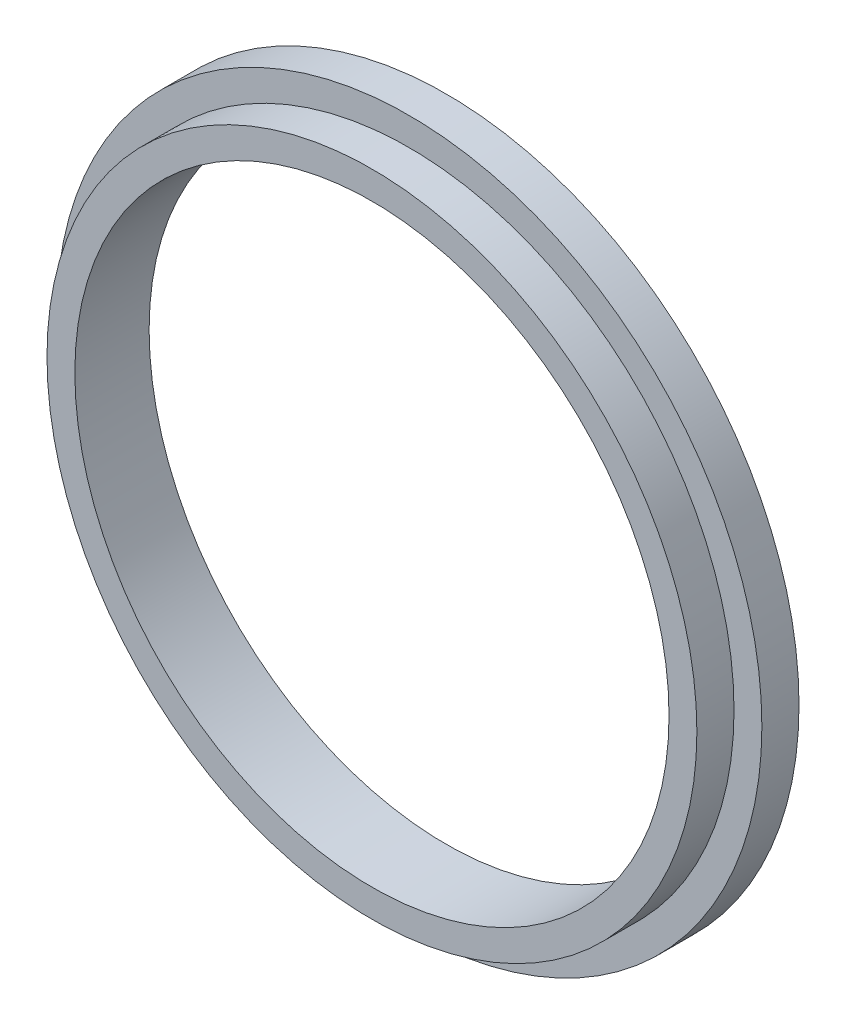
ISO-10303-21;
HEADER;
FILE_DESCRIPTION(('STEP AP214'),'2;1');
FILE_NAME('part.step','',(''),(''),'','','');
FILE_SCHEMA(('AUTOMOTIVE_DESIGN { 1 0 10303 214 1 1 1 1 }'));
ENDSEC;
DATA;
#1=APPLICATION_CONTEXT('core data for automotive mechanical design processes');
#2=APPLICATION_PROTOCOL_DEFINITION('international standard','automotive_design',2000,#1);
#3=PRODUCT_CONTEXT('',#1,'mechanical');
#4=PRODUCT('Part','Part','',(#3));
#5=PRODUCT_RELATED_PRODUCT_CATEGORY('part','',(#4));
#6=PRODUCT_DEFINITION_FORMATION('','',#4);
#7=PRODUCT_DEFINITION_CONTEXT('part definition',#1,'design');
#8=PRODUCT_DEFINITION('design','',#6,#7);
#9=PRODUCT_DEFINITION_SHAPE('','',#8);
#10=(LENGTH_UNIT() NAMED_UNIT(*) SI_UNIT(.MILLI.,.METRE.));
#11=(NAMED_UNIT(*) PLANE_ANGLE_UNIT() SI_UNIT($,.RADIAN.));
#12=(NAMED_UNIT(*) SI_UNIT($,.STERADIAN.) SOLID_ANGLE_UNIT());
#13=UNCERTAINTY_MEASURE_WITH_UNIT(LENGTH_MEASURE(1.E-05),#10,'distance_accuracy_value','');
#14=(GEOMETRIC_REPRESENTATION_CONTEXT(3) GLOBAL_UNCERTAINTY_ASSIGNED_CONTEXT((#13)) GLOBAL_UNIT_ASSIGNED_CONTEXT((#10,
#11,#12)) REPRESENTATION_CONTEXT('',''));
#15=CARTESIAN_POINT('',(0.,0.,0.));
#16=DIRECTION('',(0.,0.,1.));
#17=DIRECTION('',(1.,0.,0.));
#18=AXIS2_PLACEMENT_3D('',#15,#16,#17);
#19=CARTESIAN_POINT('',(0.,0.,20.));
#20=DIRECTION('',(0.,0.,1.));
#21=DIRECTION('',(1.,0.,0.));
#22=AXIS2_PLACEMENT_3D('',#19,#20,#21);
#23=PLANE('',#22);
#24=CARTESIAN_POINT('',(0.,0.,20.));
#25=DIRECTION('',(0.,0.,1.));
#26=DIRECTION('',(1.,0.,0.));
#27=AXIS2_PLACEMENT_3D('',#24,#25,#26);
#28=CIRCLE('',#27,190.);
#29=CARTESIAN_POINT('',(190.,0.,20.));
#30=VERTEX_POINT('',#29);
#31=EDGE_CURVE('E10',#30,#30,#28,.T.);
#32=ORIENTED_EDGE('',*,*,#31,.T.);
#33=EDGE_LOOP('',(#32));
#34=FACE_BOUND('',#33,.T.);
#35=CARTESIAN_POINT('',(0.,0.,20.));
#36=DIRECTION('',(0.,0.,1.));
#37=DIRECTION('',(1.,0.,0.));
#38=AXIS2_PLACEMENT_3D('',#35,#36,#37);
#39=CIRCLE('',#38,175.);
#40=CARTESIAN_POINT('',(175.,0.,20.));
#41=VERTEX_POINT('',#40);
#42=EDGE_CURVE('E52',#41,#41,#39,.T.);
#43=ORIENTED_EDGE('',*,*,#42,.F.);
#44=EDGE_LOOP('',(#43));
#45=FACE_BOUND('',#44,.T.);
#46=ADVANCED_FACE('F36',(#34,#45),#23,.T.);
#47=CARTESIAN_POINT('',(0.,0.,0.));
#48=DIRECTION('',(0.,0.,1.));
#49=DIRECTION('',(1.,0.,0.));
#50=AXIS2_PLACEMENT_3D('',#47,#48,#49);
#51=PLANE('',#50);
#52=CARTESIAN_POINT('',(0.,0.,0.));
#53=DIRECTION('',(0.,0.,1.));
#54=DIRECTION('',(1.,0.,0.));
#55=AXIS2_PLACEMENT_3D('',#52,#53,#54);
#56=CIRCLE('',#55,190.);
#57=CARTESIAN_POINT('',(190.,0.,0.));
#58=VERTEX_POINT('',#57);
#59=EDGE_CURVE('E40',#58,#58,#56,.T.);
#60=ORIENTED_EDGE('',*,*,#59,.F.);
#61=EDGE_LOOP('',(#60));
#62=FACE_BOUND('',#61,.T.);
#63=CARTESIAN_POINT('',(0.,0.,0.));
#64=DIRECTION('',(0.,0.,1.));
#65=DIRECTION('',(1.,0.,0.));
#66=AXIS2_PLACEMENT_3D('',#63,#64,#65);
#67=CIRCLE('',#66,160.);
#68=CARTESIAN_POINT('',(160.,0.,0.));
#69=VERTEX_POINT('',#68);
#70=EDGE_CURVE('E47',#69,#69,#67,.T.);
#71=ORIENTED_EDGE('',*,*,#70,.T.);
#72=EDGE_LOOP('',(#71));
#73=FACE_BOUND('',#72,.T.);
#74=ADVANCED_FACE('F77',(#62,#73),#51,.F.);
#75=CARTESIAN_POINT('',(0.,0.,20.));
#76=DIRECTION('',(0.,0.,-1.));
#77=DIRECTION('',(-1.,0.,0.));
#78=AXIS2_PLACEMENT_3D('',#75,#76,#77);
#79=CYLINDRICAL_SURFACE('',#78,190.);
#80=ORIENTED_EDGE('',*,*,#31,.F.);
#81=EDGE_LOOP('',(#80));
#82=FACE_BOUND('',#81,.T.);
#83=ORIENTED_EDGE('',*,*,#59,.T.);
#84=EDGE_LOOP('',(#83));
#85=FACE_BOUND('',#84,.T.);
#86=ADVANCED_FACE('F38',(#82,#85),#79,.T.);
#87=CARTESIAN_POINT('',(0.,0.,20.));
#88=DIRECTION('',(0.,0.,-1.));
#89=DIRECTION('',(-1.,0.,0.));
#90=AXIS2_PLACEMENT_3D('',#87,#88,#89);
#91=CYLINDRICAL_SURFACE('',#90,160.);
#92=ORIENTED_EDGE('',*,*,#70,.F.);
#93=EDGE_LOOP('',(#92));
#94=FACE_BOUND('',#93,.T.);
#95=CARTESIAN_POINT('',(0.,0.,40.));
#96=DIRECTION('',(0.,0.,1.));
#97=DIRECTION('',(1.,0.,0.));
#98=AXIS2_PLACEMENT_3D('',#95,#96,#97);
#99=CIRCLE('',#98,160.);
#100=CARTESIAN_POINT('',(160.,0.,40.));
#101=VERTEX_POINT('',#100);
#102=EDGE_CURVE('E55',#101,#101,#99,.T.);
#103=ORIENTED_EDGE('',*,*,#102,.T.);
#104=EDGE_LOOP('',(#103));
#105=FACE_BOUND('',#104,.T.);
#106=ADVANCED_FACE('F61',(#94,#105),#91,.F.);
#107=CARTESIAN_POINT('',(0.,0.,40.));
#108=DIRECTION('',(0.,0.,1.));
#109=DIRECTION('',(1.,0.,0.));
#110=AXIS2_PLACEMENT_3D('',#107,#108,#109);
#111=PLANE('',#110);
#112=CARTESIAN_POINT('',(0.,0.,40.));
#113=DIRECTION('',(0.,0.,1.));
#114=DIRECTION('',(1.,0.,0.));
#115=AXIS2_PLACEMENT_3D('',#112,#113,#114);
#116=CIRCLE('',#115,175.);
#117=CARTESIAN_POINT('',(175.,0.,40.));
#118=VERTEX_POINT('',#117);
#119=EDGE_CURVE('E51',#118,#118,#116,.T.);
#120=ORIENTED_EDGE('',*,*,#119,.T.);
#121=EDGE_LOOP('',(#120));
#122=FACE_BOUND('',#121,.T.);
#123=ORIENTED_EDGE('',*,*,#102,.F.);
#124=EDGE_LOOP('',(#123));
#125=FACE_BOUND('',#124,.T.);
#126=ADVANCED_FACE('F63',(#122,#125),#111,.T.);
#127=CARTESIAN_POINT('',(0.,0.,40.));
#128=DIRECTION('',(0.,0.,-1.));
#129=DIRECTION('',(-1.,0.,0.));
#130=AXIS2_PLACEMENT_3D('',#127,#128,#129);
#131=CYLINDRICAL_SURFACE('',#130,175.);
#132=ORIENTED_EDGE('',*,*,#119,.F.);
#133=EDGE_LOOP('',(#132));
#134=FACE_BOUND('',#133,.T.);
#135=ORIENTED_EDGE('',*,*,#42,.T.);
#136=EDGE_LOOP('',(#135));
#137=FACE_BOUND('',#136,.T.);
#138=ADVANCED_FACE('F65',(#134,#137),#131,.T.);
#139=CLOSED_SHELL('',(#46,#74,#86,#106,#126,#138));
#140=MANIFOLD_SOLID_BREP('B2',#139);
#141=ADVANCED_BREP_SHAPE_REPRESENTATION('',(#18,#140),#14);
#142=SHAPE_DEFINITION_REPRESENTATION(#9,#141);
ENDSEC;
END-ISO-10303-21;
